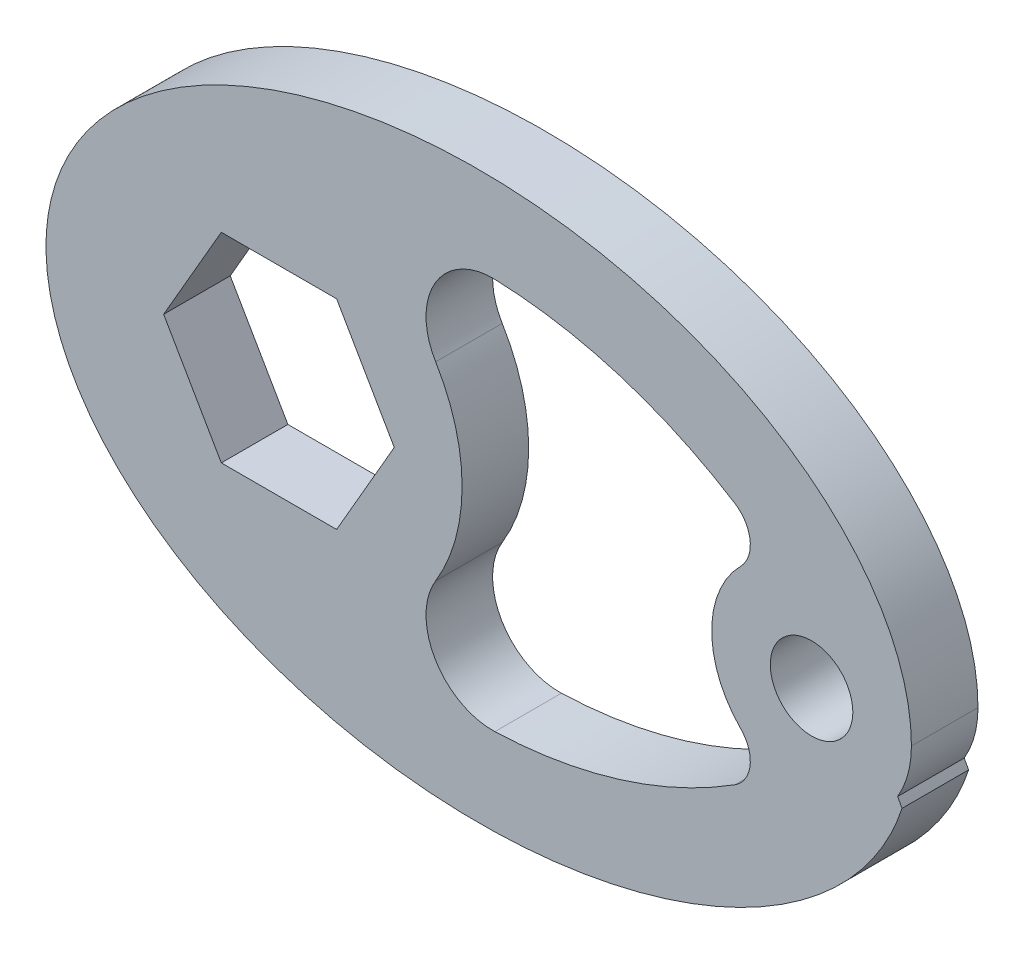
ISO-10303-21;
HEADER;
FILE_DESCRIPTION(('STEP AP214'),'2;1');
FILE_NAME('part.step','',(''),(''),'','','');
FILE_SCHEMA(('AUTOMOTIVE_DESIGN { 1 0 10303 214 1 1 1 1 }'));
ENDSEC;
DATA;
#1=APPLICATION_CONTEXT('core data for automotive mechanical design processes');
#2=APPLICATION_PROTOCOL_DEFINITION('international standard','automotive_design',2000,#1);
#3=PRODUCT_CONTEXT('',#1,'mechanical');
#4=PRODUCT('Part','Part','',(#3));
#5=PRODUCT_RELATED_PRODUCT_CATEGORY('part','',(#4));
#6=PRODUCT_DEFINITION_FORMATION('','',#4);
#7=PRODUCT_DEFINITION_CONTEXT('part definition',#1,'design');
#8=PRODUCT_DEFINITION('design','',#6,#7);
#9=PRODUCT_DEFINITION_SHAPE('','',#8);
#10=(LENGTH_UNIT() NAMED_UNIT(*) SI_UNIT(.MILLI.,.METRE.));
#11=(NAMED_UNIT(*) PLANE_ANGLE_UNIT() SI_UNIT($,.RADIAN.));
#12=(NAMED_UNIT(*) SI_UNIT($,.STERADIAN.) SOLID_ANGLE_UNIT());
#13=UNCERTAINTY_MEASURE_WITH_UNIT(LENGTH_MEASURE(1.E-05),#10,'distance_accuracy_value','');
#14=(GEOMETRIC_REPRESENTATION_CONTEXT(3) GLOBAL_UNCERTAINTY_ASSIGNED_CONTEXT((#13)) GLOBAL_UNIT_ASSIGNED_CONTEXT((#10,
#11,#12)) REPRESENTATION_CONTEXT('',''));
#15=CARTESIAN_POINT('',(0.,0.,0.));
#16=DIRECTION('',(0.,0.,1.));
#17=DIRECTION('',(1.,0.,0.));
#18=AXIS2_PLACEMENT_3D('',#15,#16,#17);
#19=CARTESIAN_POINT('',(63.5,0.,12.7));
#20=DIRECTION('',(0.,0.,-1.));
#21=DIRECTION('',(-1.,0.,0.));
#22=AXIS2_PLACEMENT_3D('',#19,#20,#21);
#23=CYLINDRICAL_SURFACE('',#22,19.05);
#24=CARTESIAN_POINT('',(63.5,0.,0.));
#25=DIRECTION('',(0.,0.,1.));
#26=DIRECTION('',(1.,0.,0.));
#27=AXIS2_PLACEMENT_3D('',#24,#25,#26);
#28=CIRCLE('',#27,19.05);
#29=CARTESIAN_POINT('',(79.9202009180648,-9.65813138295304,0.));
#30=VERTEX_POINT('',#29);
#31=CARTESIAN_POINT('',(82.55,0.,0.));
#32=VERTEX_POINT('',#31);
#33=EDGE_CURVE('E174',#30,#32,#28,.T.);
#34=ORIENTED_EDGE('',*,*,#33,.T.);
#35=DIRECTION('',(0.,0.,-1.));
#36=VECTOR('',#35,1.);
#37=CARTESIAN_POINT('',(82.55,0.,12.7));
#38=LINE('',#37,#36);
#39=CARTESIAN_POINT('',(82.55,0.,12.7));
#40=VERTEX_POINT('',#39);
#41=EDGE_CURVE('E11',#40,#32,#38,.T.);
#42=ORIENTED_EDGE('',*,*,#41,.F.);
#43=CARTESIAN_POINT('',(63.5,0.,12.7));
#44=DIRECTION('',(0.,0.,1.));
#45=DIRECTION('',(1.,0.,0.));
#46=AXIS2_PLACEMENT_3D('',#43,#44,#45);
#47=CIRCLE('',#46,19.05);
#48=CARTESIAN_POINT('',(79.9202009180648,-9.65813138295304,12.7));
#49=VERTEX_POINT('',#48);
#50=EDGE_CURVE('E166',#49,#40,#47,.T.);
#51=ORIENTED_EDGE('',*,*,#50,.F.);
#52=DIRECTION('',(0.,0.,-1.));
#53=VECTOR('',#52,1.);
#54=CARTESIAN_POINT('',(79.9202009180648,-9.65813138295304,12.7));
#55=LINE('',#54,#53);
#56=EDGE_CURVE('E175',#49,#30,#55,.T.);
#57=ORIENTED_EDGE('',*,*,#56,.T.);
#58=EDGE_LOOP('',(#34,#42,#51,#57));
#59=FACE_BOUND('',#58,.T.);
#60=ADVANCED_FACE('F35',(#59),#23,.T.);
#61=CARTESIAN_POINT('',(0.,0.,12.7));
#62=DIRECTION('',(0.,0.,1.));
#63=DIRECTION('',(1.,0.,0.));
#64=AXIS2_PLACEMENT_3D('',#61,#62,#63);
#65=ELLIPSE('',#64,82.55,53.975);
#66=DIRECTION('',(0.,0.,-1.));
#67=VECTOR('',#66,1.);
#68=SURFACE_OF_LINEAR_EXTRUSION('',#65,#67);
#69=CARTESIAN_POINT('',(0.,0.,0.));
#70=DIRECTION('',(0.,0.,1.));
#71=DIRECTION('',(1.,0.,0.));
#72=AXIS2_PLACEMENT_3D('',#69,#70,#71);
#73=ELLIPSE('',#72,82.55,53.975);
#74=CARTESIAN_POINT('',(80.7542674563198,-11.1968321290213,0.));
#75=VERTEX_POINT('',#74);
#76=EDGE_CURVE('E108',#32,#75,#73,.T.);
#77=ORIENTED_EDGE('',*,*,#76,.T.);
#78=DIRECTION('',(0.,0.,-1.));
#79=VECTOR('',#78,1.);
#80=CARTESIAN_POINT('',(80.7542674563198,-11.1968321290213,12.7));
#81=LINE('',#80,#79);
#82=CARTESIAN_POINT('',(80.7542674563198,-11.1968321290213,12.7));
#83=VERTEX_POINT('',#82);
#84=EDGE_CURVE('E45',#83,#75,#81,.T.);
#85=ORIENTED_EDGE('',*,*,#84,.F.);
#86=EDGE_CURVE('E162',#40,#83,#65,.T.);
#87=ORIENTED_EDGE('',*,*,#86,.F.);
#88=ORIENTED_EDGE('',*,*,#41,.T.);
#89=EDGE_LOOP('',(#77,#85,#87,#88));
#90=FACE_BOUND('',#89,.T.);
#91=ADVANCED_FACE('F163',(#90),#68,.F.);
#92=CARTESIAN_POINT('',(-12.0772160579065,6.97278394209356,12.7));
#93=DIRECTION('',(-0.866025403784439,0.5,0.));
#94=DIRECTION('',(-0.5,-0.866025403784439,0.));
#95=AXIS2_PLACEMENT_3D('',#92,#93,#94);
#96=PLANE('',#95);
#97=DIRECTION('',(0.5,0.866025403784439,0.));
#98=VECTOR('',#97,1.);
#99=CARTESIAN_POINT('',(-12.0772160579065,6.97278394209356,0.));
#100=LINE('',#99,#98);
#101=CARTESIAN_POINT('',(-27.1014773719376,-19.05,0.));
#102=VERTEX_POINT('',#101);
#103=CARTESIAN_POINT('',(-16.1029547438753,0.,0.));
#104=VERTEX_POINT('',#103);
#105=EDGE_CURVE('E253',#102,#104,#100,.T.);
#106=ORIENTED_EDGE('',*,*,#105,.F.);
#107=DIRECTION('',(0.,0.,-1.));
#108=VECTOR('',#107,1.);
#109=CARTESIAN_POINT('',(-27.1014773719376,-19.05,12.7));
#110=LINE('',#109,#108);
#111=CARTESIAN_POINT('',(-27.1014773719376,-19.05,12.7));
#112=VERTEX_POINT('',#111);
#113=EDGE_CURVE('E188',#112,#102,#110,.T.);
#114=ORIENTED_EDGE('',*,*,#113,.F.);
#115=DIRECTION('',(0.5,0.866025403784439,0.));
#116=VECTOR('',#115,1.);
#117=CARTESIAN_POINT('',(-12.0772160579065,6.97278394209356,12.7));
#118=LINE('',#117,#116);
#119=CARTESIAN_POINT('',(-16.1029547438753,0.,12.7));
#120=VERTEX_POINT('',#119);
#121=EDGE_CURVE('E303',#112,#120,#118,.T.);
#122=ORIENTED_EDGE('',*,*,#121,.T.);
#123=DIRECTION('',(0.,0.,-1.));
#124=VECTOR('',#123,1.);
#125=CARTESIAN_POINT('',(-16.1029547438753,0.,12.7));
#126=LINE('',#125,#124);
#127=EDGE_CURVE('E190',#120,#104,#126,.T.);
#128=ORIENTED_EDGE('',*,*,#127,.T.);
#129=EDGE_LOOP('',(#106,#114,#122,#128));
#130=FACE_BOUND('',#129,.T.);
#131=ADVANCED_FACE('F302',(#130),#96,.T.);
#132=CARTESIAN_POINT('',(0.,-19.05,12.7));
#133=DIRECTION('',(0.,1.,0.));
#134=DIRECTION('',(-1.,0.,0.));
#135=AXIS2_PLACEMENT_3D('',#132,#133,#134);
#136=PLANE('',#135);
#137=DIRECTION('',(1.,0.,0.));
#138=VECTOR('',#137,1.);
#139=CARTESIAN_POINT('',(0.,-19.05,0.));
#140=LINE('',#139,#138);
#141=CARTESIAN_POINT('',(-49.0985226280624,-19.05,0.));
#142=VERTEX_POINT('',#141);
#143=EDGE_CURVE('E256',#142,#102,#140,.T.);
#144=ORIENTED_EDGE('',*,*,#143,.F.);
#145=DIRECTION('',(0.,0.,-1.));
#146=VECTOR('',#145,1.);
#147=CARTESIAN_POINT('',(-49.0985226280624,-19.05,12.7));
#148=LINE('',#147,#146);
#149=CARTESIAN_POINT('',(-49.0985226280624,-19.05,12.7));
#150=VERTEX_POINT('',#149);
#151=EDGE_CURVE('E198',#150,#142,#148,.T.);
#152=ORIENTED_EDGE('',*,*,#151,.F.);
#153=DIRECTION('',(1.,0.,0.));
#154=VECTOR('',#153,1.);
#155=CARTESIAN_POINT('',(0.,-19.05,12.7));
#156=LINE('',#155,#154);
#157=EDGE_CURVE('E299',#150,#112,#156,.T.);
#158=ORIENTED_EDGE('',*,*,#157,.T.);
#159=ORIENTED_EDGE('',*,*,#113,.T.);
#160=EDGE_LOOP('',(#144,#152,#158,#159));
#161=FACE_BOUND('',#160,.T.);
#162=ADVANCED_FACE('F298',(#161),#136,.T.);
#163=CARTESIAN_POINT('',(-45.0727839420935,-26.0227839420936,12.7));
#164=DIRECTION('',(0.866025403784439,0.5,0.));
#165=DIRECTION('',(-0.5,0.866025403784439,0.));
#166=AXIS2_PLACEMENT_3D('',#163,#164,#165);
#167=PLANE('',#166);
#168=DIRECTION('',(0.5,-0.866025403784439,0.));
#169=VECTOR('',#168,1.);
#170=CARTESIAN_POINT('',(-45.0727839420935,-26.0227839420936,0.));
#171=LINE('',#170,#169);
#172=CARTESIAN_POINT('',(-60.0970452561248,0.,0.));
#173=VERTEX_POINT('',#172);
#174=EDGE_CURVE('E259',#173,#142,#171,.T.);
#175=ORIENTED_EDGE('',*,*,#174,.F.);
#176=DIRECTION('',(0.,0.,-1.));
#177=VECTOR('',#176,1.);
#178=CARTESIAN_POINT('',(-60.0970452561248,0.,12.7));
#179=LINE('',#178,#177);
#180=CARTESIAN_POINT('',(-60.0970452561248,0.,12.7));
#181=VERTEX_POINT('',#180);
#182=EDGE_CURVE('E196',#181,#173,#179,.T.);
#183=ORIENTED_EDGE('',*,*,#182,.F.);
#184=DIRECTION('',(0.5,-0.866025403784439,0.));
#185=VECTOR('',#184,1.);
#186=CARTESIAN_POINT('',(-45.0727839420935,-26.0227839420936,12.7));
#187=LINE('',#186,#185);
#188=EDGE_CURVE('E294',#181,#150,#187,.T.);
#189=ORIENTED_EDGE('',*,*,#188,.T.);
#190=ORIENTED_EDGE('',*,*,#151,.T.);
#191=EDGE_LOOP('',(#175,#183,#189,#190));
#192=FACE_BOUND('',#191,.T.);
#193=ADVANCED_FACE('F291',(#192),#167,.T.);
#194=CARTESIAN_POINT('',(-45.0727839420936,26.0227839420936,12.7));
#195=DIRECTION('',(0.866025403784439,-0.5,0.));
#196=DIRECTION('',(0.5,0.866025403784439,0.));
#197=AXIS2_PLACEMENT_3D('',#194,#195,#196);
#198=PLANE('',#197);
#199=DIRECTION('',(-0.5,-0.866025403784439,0.));
#200=VECTOR('',#199,1.);
#201=CARTESIAN_POINT('',(-45.0727839420936,26.0227839420936,0.));
#202=LINE('',#201,#200);
#203=CARTESIAN_POINT('',(-49.0985226280624,19.05,0.));
#204=VERTEX_POINT('',#203);
#205=EDGE_CURVE('E262',#204,#173,#202,.T.);
#206=ORIENTED_EDGE('',*,*,#205,.F.);
#207=DIRECTION('',(0.,0.,-1.));
#208=VECTOR('',#207,1.);
#209=CARTESIAN_POINT('',(-49.0985226280624,19.05,12.7));
#210=LINE('',#209,#208);
#211=CARTESIAN_POINT('',(-49.0985226280624,19.05,12.7));
#212=VERTEX_POINT('',#211);
#213=EDGE_CURVE('E194',#212,#204,#210,.T.);
#214=ORIENTED_EDGE('',*,*,#213,.F.);
#215=DIRECTION('',(-0.5,-0.866025403784439,0.));
#216=VECTOR('',#215,1.);
#217=CARTESIAN_POINT('',(-45.0727839420936,26.0227839420936,12.7));
#218=LINE('',#217,#216);
#219=EDGE_CURVE('E311',#212,#181,#218,.T.);
#220=ORIENTED_EDGE('',*,*,#219,.T.);
#221=ORIENTED_EDGE('',*,*,#182,.T.);
#222=EDGE_LOOP('',(#206,#214,#220,#221));
#223=FACE_BOUND('',#222,.T.);
#224=ADVANCED_FACE('F287',(#223),#198,.T.);
#225=CARTESIAN_POINT('',(0.,19.05,12.7));
#226=DIRECTION('',(0.,-1.,0.));
#227=DIRECTION('',(1.,0.,0.));
#228=AXIS2_PLACEMENT_3D('',#225,#226,#227);
#229=PLANE('',#228);
#230=DIRECTION('',(-1.,0.,0.));
#231=VECTOR('',#230,1.);
#232=CARTESIAN_POINT('',(0.,19.05,0.));
#233=LINE('',#232,#231);
#234=CARTESIAN_POINT('',(-27.1014773719376,19.05,0.));
#235=VERTEX_POINT('',#234);
#236=EDGE_CURVE('E265',#235,#204,#233,.T.);
#237=ORIENTED_EDGE('',*,*,#236,.F.);
#238=DIRECTION('',(0.,0.,-1.));
#239=VECTOR('',#238,1.);
#240=CARTESIAN_POINT('',(-27.1014773719376,19.05,12.7));
#241=LINE('',#240,#239);
#242=CARTESIAN_POINT('',(-27.1014773719376,19.05,12.7));
#243=VERTEX_POINT('',#242);
#244=EDGE_CURVE('E192',#243,#235,#241,.T.);
#245=ORIENTED_EDGE('',*,*,#244,.F.);
#246=DIRECTION('',(-1.,0.,0.));
#247=VECTOR('',#246,1.);
#248=CARTESIAN_POINT('',(0.,19.05,12.7));
#249=LINE('',#248,#247);
#250=EDGE_CURVE('E283',#243,#212,#249,.T.);
#251=ORIENTED_EDGE('',*,*,#250,.T.);
#252=ORIENTED_EDGE('',*,*,#213,.T.);
#253=EDGE_LOOP('',(#237,#245,#251,#252));
#254=FACE_BOUND('',#253,.T.);
#255=ADVANCED_FACE('F281',(#254),#229,.T.);
#256=CARTESIAN_POINT('',(2.65555798937363,-24.6652038216592,12.7));
#257=DIRECTION('',(0.,0.,-1.));
#258=DIRECTION('',(-1.,0.,0.));
#259=AXIS2_PLACEMENT_3D('',#256,#257,#258);
#260=CYLINDRICAL_SURFACE('',#259,12.7);
#261=CARTESIAN_POINT('',(2.65555798937363,-24.6652038216592,0.));
#262=DIRECTION('',(0.,0.,1.));
#263=DIRECTION('',(1.,0.,0.));
#264=AXIS2_PLACEMENT_3D('',#261,#262,#263);
#265=CIRCLE('',#264,12.7);
#266=CARTESIAN_POINT('',(-8.20960405503424,-18.089623714265,0.));
#267=VERTEX_POINT('',#266);
#268=CARTESIAN_POINT('',(3.08417302941597,-37.3579690502235,0.));
#269=VERTEX_POINT('',#268);
#270=EDGE_CURVE('E232',#267,#269,#265,.T.);
#271=ORIENTED_EDGE('',*,*,#270,.F.);
#272=DIRECTION('',(0.,0.,-1.));
#273=VECTOR('',#272,1.);
#274=CARTESIAN_POINT('',(-8.20960405503424,-18.089623714265,12.7));
#275=LINE('',#274,#273);
#276=CARTESIAN_POINT('',(-8.20960405503424,-18.089623714265,12.7));
#277=VERTEX_POINT('',#276);
#278=EDGE_CURVE('E39',#277,#267,#275,.T.);
#279=ORIENTED_EDGE('',*,*,#278,.F.);
#280=CARTESIAN_POINT('',(2.65555798937363,-24.6652038216592,12.7));
#281=DIRECTION('',(0.,0.,1.));
#282=DIRECTION('',(1.,0.,0.));
#283=AXIS2_PLACEMENT_3D('',#280,#281,#282);
#284=CIRCLE('',#283,12.7);
#285=CARTESIAN_POINT('',(3.08417302941597,-37.3579690502235,12.7));
#286=VERTEX_POINT('',#285);
#287=EDGE_CURVE('E186',#277,#286,#284,.T.);
#288=ORIENTED_EDGE('',*,*,#287,.T.);
#289=DIRECTION('',(0.,0.,-1.));
#290=VECTOR('',#289,1.);
#291=CARTESIAN_POINT('',(3.08417302941597,-37.3579690502235,12.7));
#292=LINE('',#291,#290);
#293=EDGE_CURVE('E201',#286,#269,#292,.T.);
#294=ORIENTED_EDGE('',*,*,#293,.T.);
#295=EDGE_LOOP('',(#271,#279,#288,#294));
#296=FACE_BOUND('',#295,.T.);
#297=ADVANCED_FACE('F37',(#296),#260,.F.);
#298=CARTESIAN_POINT('',(-38.1,0.,12.7));
#299=DIRECTION('',(0.,0.,-1.));
#300=DIRECTION('',(-1.,0.,0.));
#301=AXIS2_PLACEMENT_3D('',#298,#299,#300);
#302=CYLINDRICAL_SURFACE('',#301,34.9380917605774);
#303=CARTESIAN_POINT('',(-38.1,0.,0.));
#304=DIRECTION('',(0.,0.,1.));
#305=DIRECTION('',(1.,0.,0.));
#306=AXIS2_PLACEMENT_3D('',#303,#304,#305);
#307=CIRCLE('',#306,34.9380917605774);
#308=CARTESIAN_POINT('',(-8.20960405503424,18.089623714265,0.));
#309=VERTEX_POINT('',#308);
#310=EDGE_CURVE('E224',#267,#309,#307,.T.);
#311=ORIENTED_EDGE('',*,*,#310,.T.);
#312=DIRECTION('',(0.,0.,-1.));
#313=VECTOR('',#312,1.);
#314=CARTESIAN_POINT('',(-8.20960405503424,18.089623714265,12.7));
#315=LINE('',#314,#313);
#316=CARTESIAN_POINT('',(-8.20960405503424,18.089623714265,12.7));
#317=VERTEX_POINT('',#316);
#318=EDGE_CURVE('E214',#317,#309,#315,.T.);
#319=ORIENTED_EDGE('',*,*,#318,.F.);
#320=CARTESIAN_POINT('',(-38.1,0.,12.7));
#321=DIRECTION('',(0.,0.,1.));
#322=DIRECTION('',(1.,0.,0.));
#323=AXIS2_PLACEMENT_3D('',#320,#321,#322);
#324=CIRCLE('',#323,34.9380917605774);
#325=EDGE_CURVE('E225',#277,#317,#324,.T.);
#326=ORIENTED_EDGE('',*,*,#325,.F.);
#327=ORIENTED_EDGE('',*,*,#278,.T.);
#328=EDGE_LOOP('',(#311,#319,#326,#327));
#329=FACE_BOUND('',#328,.T.);
#330=ADVANCED_FACE('F223',(#329),#302,.T.);
#331=CARTESIAN_POINT('',(2.65555798937363,24.6652038216592,12.7));
#332=DIRECTION('',(0.,0.,-1.));
#333=DIRECTION('',(-1.,0.,0.));
#334=AXIS2_PLACEMENT_3D('',#331,#332,#333);
#335=CYLINDRICAL_SURFACE('',#334,12.7);
#336=CARTESIAN_POINT('',(2.65555798937363,24.6652038216592,0.));
#337=DIRECTION('',(0.,0.,1.));
#338=DIRECTION('',(1.,0.,0.));
#339=AXIS2_PLACEMENT_3D('',#336,#337,#338);
#340=CIRCLE('',#339,12.7);
#341=CARTESIAN_POINT('',(3.08417302941596,37.3579690502235,0.));
#342=VERTEX_POINT('',#341);
#343=EDGE_CURVE('E234',#309,#342,#340,.F.);
#344=ORIENTED_EDGE('',*,*,#343,.T.);
#345=DIRECTION('',(0.,0.,-1.));
#346=VECTOR('',#345,1.);
#347=CARTESIAN_POINT('',(3.08417302941596,37.3579690502235,12.7));
#348=LINE('',#347,#346);
#349=CARTESIAN_POINT('',(3.08417302941596,37.3579690502235,12.7));
#350=VERTEX_POINT('',#349);
#351=EDGE_CURVE('E213',#350,#342,#348,.T.);
#352=ORIENTED_EDGE('',*,*,#351,.F.);
#353=CARTESIAN_POINT('',(2.65555798937363,24.6652038216592,12.7));
#354=DIRECTION('',(0.,0.,1.));
#355=DIRECTION('',(1.,0.,0.));
#356=AXIS2_PLACEMENT_3D('',#353,#354,#355);
#357=CIRCLE('',#356,12.7);
#358=EDGE_CURVE('E490',#317,#350,#357,.F.);
#359=ORIENTED_EDGE('',*,*,#358,.F.);
#360=ORIENTED_EDGE('',*,*,#318,.T.);
#361=EDGE_LOOP('',(#344,#352,#359,#360));
#362=FACE_BOUND('',#361,.T.);
#363=ADVANCED_FACE('F358',(#362),#335,.F.);
#364=CARTESIAN_POINT('',(0.,-53.975,12.7));
#365=DIRECTION('',(0.,0.,-1.));
#366=DIRECTION('',(-1.,0.,0.));
#367=AXIS2_PLACEMENT_3D('',#364,#365,#366);
#368=CYLINDRICAL_SURFACE('',#367,91.3850280888749);
#369=CARTESIAN_POINT('',(0.,-53.975,0.));
#370=DIRECTION('',(0.,0.,1.));
#371=DIRECTION('',(1.,0.,0.));
#372=AXIS2_PLACEMENT_3D('',#369,#370,#371);
#373=CIRCLE('',#372,91.3850280888749);
#374=CARTESIAN_POINT('',(48.85977358339,23.2515879356606,0.));
#375=VERTEX_POINT('',#374);
#376=EDGE_CURVE('E242',#375,#342,#373,.T.);
#377=ORIENTED_EDGE('',*,*,#376,.F.);
#378=DIRECTION('',(0.,0.,-1.));
#379=VECTOR('',#378,1.);
#380=CARTESIAN_POINT('',(48.85977358339,23.2515879356606,12.7));
#381=LINE('',#380,#379);
#382=CARTESIAN_POINT('',(48.85977358339,23.2515879356606,12.7));
#383=VERTEX_POINT('',#382);
#384=EDGE_CURVE('E211',#383,#375,#381,.T.);
#385=ORIENTED_EDGE('',*,*,#384,.F.);
#386=CARTESIAN_POINT('',(0.,-53.975,12.7));
#387=DIRECTION('',(0.,0.,1.));
#388=DIRECTION('',(1.,0.,0.));
#389=AXIS2_PLACEMENT_3D('',#386,#387,#388);
#390=CIRCLE('',#389,91.3850280888749);
#391=EDGE_CURVE('E494',#383,#350,#390,.T.);
#392=ORIENTED_EDGE('',*,*,#391,.T.);
#393=ORIENTED_EDGE('',*,*,#351,.T.);
#394=EDGE_LOOP('',(#377,#385,#392,#393));
#395=FACE_BOUND('',#394,.T.);
#396=ADVANCED_FACE('F354',(#395),#368,.F.);
#397=CARTESIAN_POINT('',(45.4646926960395,17.8854043972092,12.7));
#398=DIRECTION('',(0.,0.,-1.));
#399=DIRECTION('',(-1.,0.,0.));
#400=AXIS2_PLACEMENT_3D('',#397,#398,#399);
#401=CYLINDRICAL_SURFACE('',#400,6.34999999999999);
#402=CARTESIAN_POINT('',(45.4646926960395,17.8854043972092,0.));
#403=DIRECTION('',(0.,0.,1.));
#404=DIRECTION('',(1.,0.,0.));
#405=AXIS2_PLACEMENT_3D('',#402,#403,#404);
#406=CIRCLE('',#405,6.34999999999999);
#407=CARTESIAN_POINT('',(49.9735195220296,13.4140532979069,0.));
#408=VERTEX_POINT('',#407);
#409=EDGE_CURVE('E244',#408,#375,#406,.T.);
#410=ORIENTED_EDGE('',*,*,#409,.F.);
#411=DIRECTION('',(0.,0.,-1.));
#412=VECTOR('',#411,1.);
#413=CARTESIAN_POINT('',(49.9735195220296,13.4140532979069,12.7));
#414=LINE('',#413,#412);
#415=CARTESIAN_POINT('',(49.9735195220296,13.4140532979069,12.7));
#416=VERTEX_POINT('',#415);
#417=EDGE_CURVE('E209',#416,#408,#414,.T.);
#418=ORIENTED_EDGE('',*,*,#417,.F.);
#419=CARTESIAN_POINT('',(45.4646926960395,17.8854043972092,12.7));
#420=DIRECTION('',(0.,0.,1.));
#421=DIRECTION('',(1.,0.,0.));
#422=AXIS2_PLACEMENT_3D('',#419,#420,#421);
#423=CIRCLE('',#422,6.34999999999999);
#424=EDGE_CURVE('E497',#416,#383,#423,.T.);
#425=ORIENTED_EDGE('',*,*,#424,.T.);
#426=ORIENTED_EDGE('',*,*,#384,.T.);
#427=EDGE_LOOP('',(#410,#418,#425,#426));
#428=FACE_BOUND('',#427,.T.);
#429=ADVANCED_FACE('F350',(#428),#401,.F.);
#430=CARTESIAN_POINT('',(63.5,0.,12.7));
#431=DIRECTION('',(0.,0.,-1.));
#432=DIRECTION('',(-1.,0.,0.));
#433=AXIS2_PLACEMENT_3D('',#430,#431,#432);
#434=CYLINDRICAL_SURFACE('',#433,19.05);
#435=CARTESIAN_POINT('',(63.5,0.,0.));
#436=DIRECTION('',(0.,0.,1.));
#437=DIRECTION('',(1.,0.,0.));
#438=AXIS2_PLACEMENT_3D('',#435,#436,#437);
#439=CIRCLE('',#438,19.05);
#440=CARTESIAN_POINT('',(49.9735195220296,-13.4140532979069,0.));
#441=VERTEX_POINT('',#440);
#442=EDGE_CURVE('E247',#408,#441,#439,.T.);
#443=ORIENTED_EDGE('',*,*,#442,.T.);
#444=DIRECTION('',(0.,0.,-1.));
#445=VECTOR('',#444,1.);
#446=CARTESIAN_POINT('',(49.9735195220296,-13.4140532979069,12.7));
#447=LINE('',#446,#445);
#448=CARTESIAN_POINT('',(49.9735195220296,-13.4140532979069,12.7));
#449=VERTEX_POINT('',#448);
#450=EDGE_CURVE('E206',#449,#441,#447,.T.);
#451=ORIENTED_EDGE('',*,*,#450,.F.);
#452=CARTESIAN_POINT('',(63.5,0.,12.7));
#453=DIRECTION('',(0.,0.,1.));
#454=DIRECTION('',(1.,0.,0.));
#455=AXIS2_PLACEMENT_3D('',#452,#453,#454);
#456=CIRCLE('',#455,19.05);
#457=EDGE_CURVE('E500',#416,#449,#456,.T.);
#458=ORIENTED_EDGE('',*,*,#457,.F.);
#459=ORIENTED_EDGE('',*,*,#417,.T.);
#460=EDGE_LOOP('',(#443,#451,#458,#459));
#461=FACE_BOUND('',#460,.T.);
#462=ADVANCED_FACE('F346',(#461),#434,.T.);
#463=CARTESIAN_POINT('',(45.4646926960395,-17.8854043972092,12.7));
#464=DIRECTION('',(0.,0.,-1.));
#465=DIRECTION('',(-1.,0.,0.));
#466=AXIS2_PLACEMENT_3D('',#463,#464,#465);
#467=CYLINDRICAL_SURFACE('',#466,6.34999999999999);
#468=CARTESIAN_POINT('',(45.4646926960395,-17.8854043972092,0.));
#469=DIRECTION('',(0.,0.,1.));
#470=DIRECTION('',(1.,0.,0.));
#471=AXIS2_PLACEMENT_3D('',#468,#469,#470);
#472=CIRCLE('',#471,6.34999999999999);
#473=CARTESIAN_POINT('',(48.85977358339,-23.2515879356606,0.));
#474=VERTEX_POINT('',#473);
#475=EDGE_CURVE('E249',#441,#474,#472,.F.);
#476=ORIENTED_EDGE('',*,*,#475,.T.);
#477=DIRECTION('',(0.,0.,-1.));
#478=VECTOR('',#477,1.);
#479=CARTESIAN_POINT('',(48.85977358339,-23.2515879356606,12.7));
#480=LINE('',#479,#478);
#481=CARTESIAN_POINT('',(48.85977358339,-23.2515879356606,12.7));
#482=VERTEX_POINT('',#481);
#483=EDGE_CURVE('E203',#482,#474,#480,.T.);
#484=ORIENTED_EDGE('',*,*,#483,.F.);
#485=CARTESIAN_POINT('',(45.4646926960395,-17.8854043972092,12.7));
#486=DIRECTION('',(0.,0.,1.));
#487=DIRECTION('',(1.,0.,0.));
#488=AXIS2_PLACEMENT_3D('',#485,#486,#487);
#489=CIRCLE('',#488,6.34999999999999);
#490=EDGE_CURVE('E502',#449,#482,#489,.F.);
#491=ORIENTED_EDGE('',*,*,#490,.F.);
#492=ORIENTED_EDGE('',*,*,#450,.T.);
#493=EDGE_LOOP('',(#476,#484,#491,#492));
#494=FACE_BOUND('',#493,.T.);
#495=ADVANCED_FACE('F326',(#494),#467,.F.);
#496=CARTESIAN_POINT('',(63.5,0.,12.7));
#497=DIRECTION('',(0.,0.,-1.));
#498=DIRECTION('',(-1.,0.,0.));
#499=AXIS2_PLACEMENT_3D('',#496,#497,#498);
#500=CYLINDRICAL_SURFACE('',#499,7.874);
#501=CARTESIAN_POINT('',(63.5,0.,12.7));
#502=DIRECTION('',(0.,0.,1.));
#503=DIRECTION('',(1.,0.,0.));
#504=AXIS2_PLACEMENT_3D('',#501,#502,#503);
#505=CIRCLE('',#504,7.874);
#506=CARTESIAN_POINT('',(71.374,0.,12.7));
#507=VERTEX_POINT('',#506);
#508=EDGE_CURVE('E171',#507,#507,#505,.T.);
#509=ORIENTED_EDGE('',*,*,#508,.T.);
#510=EDGE_LOOP('',(#509));
#511=FACE_BOUND('',#510,.T.);
#512=CARTESIAN_POINT('',(63.5,0.,0.));
#513=DIRECTION('',(0.,0.,1.));
#514=DIRECTION('',(1.,0.,0.));
#515=AXIS2_PLACEMENT_3D('',#512,#513,#514);
#516=CIRCLE('',#515,7.874);
#517=CARTESIAN_POINT('',(71.374,0.,0.));
#518=VERTEX_POINT('',#517);
#519=EDGE_CURVE('E177',#518,#518,#516,.T.);
#520=ORIENTED_EDGE('',*,*,#519,.F.);
#521=EDGE_LOOP('',(#520));
#522=FACE_BOUND('',#521,.T.);
#523=ADVANCED_FACE('F323',(#511,#522),#500,.F.);
#524=CARTESIAN_POINT('',(-12.0772160579064,-6.97278394209356,12.7));
#525=DIRECTION('',(-0.866025403784439,-0.5,0.));
#526=DIRECTION('',(0.5,-0.866025403784439,0.));
#527=AXIS2_PLACEMENT_3D('',#524,#525,#526);
#528=PLANE('',#527);
#529=DIRECTION('',(-0.5,0.866025403784439,0.));
#530=VECTOR('',#529,1.);
#531=CARTESIAN_POINT('',(-12.0772160579064,-6.97278394209356,0.));
#532=LINE('',#531,#530);
#533=EDGE_CURVE('E181',#104,#235,#532,.T.);
#534=ORIENTED_EDGE('',*,*,#533,.F.);
#535=ORIENTED_EDGE('',*,*,#127,.F.);
#536=DIRECTION('',(-0.5,0.866025403784439,0.));
#537=VECTOR('',#536,1.);
#538=CARTESIAN_POINT('',(-12.0772160579064,-6.97278394209356,12.7));
#539=LINE('',#538,#537);
#540=EDGE_CURVE('E277',#120,#243,#539,.T.);
#541=ORIENTED_EDGE('',*,*,#540,.T.);
#542=ORIENTED_EDGE('',*,*,#244,.T.);
#543=EDGE_LOOP('',(#534,#535,#541,#542));
#544=FACE_BOUND('',#543,.T.);
#545=ADVANCED_FACE('F273',(#544),#528,.T.);
#546=CARTESIAN_POINT('',(0.,53.975,12.7));
#547=DIRECTION('',(0.,0.,-1.));
#548=DIRECTION('',(-1.,0.,0.));
#549=AXIS2_PLACEMENT_3D('',#546,#547,#548);
#550=CYLINDRICAL_SURFACE('',#549,91.3850280888749);
#551=CARTESIAN_POINT('',(0.,53.975,0.));
#552=DIRECTION('',(0.,0.,1.));
#553=DIRECTION('',(1.,0.,0.));
#554=AXIS2_PLACEMENT_3D('',#551,#552,#553);
#555=CIRCLE('',#554,91.3850280888749);
#556=EDGE_CURVE('E251',#474,#269,#555,.F.);
#557=ORIENTED_EDGE('',*,*,#556,.T.);
#558=ORIENTED_EDGE('',*,*,#293,.F.);
#559=CARTESIAN_POINT('',(0.,53.975,12.7));
#560=DIRECTION('',(0.,0.,1.));
#561=DIRECTION('',(1.,0.,0.));
#562=AXIS2_PLACEMENT_3D('',#559,#560,#561);
#563=CIRCLE('',#562,91.3850280888749);
#564=EDGE_CURVE('E305',#482,#286,#563,.F.);
#565=ORIENTED_EDGE('',*,*,#564,.F.);
#566=ORIENTED_EDGE('',*,*,#483,.T.);
#567=EDGE_LOOP('',(#557,#558,#565,#566));
#568=FACE_BOUND('',#567,.T.);
#569=ADVANCED_FACE('F330',(#568),#550,.F.);
#570=CARTESIAN_POINT('',(0.,-53.975,12.7));
#571=DIRECTION('',(0.,0.,-1.));
#572=DIRECTION('',(-1.,0.,0.));
#573=AXIS2_PLACEMENT_3D('',#570,#571,#572);
#574=CYLINDRICAL_SURFACE('',#573,91.3850280888749);
#575=CARTESIAN_POINT('',(0.,-53.975,0.));
#576=DIRECTION('',(0.,0.,1.));
#577=DIRECTION('',(1.,0.,0.));
#578=AXIS2_PLACEMENT_3D('',#575,#576,#577);
#579=CIRCLE('',#578,91.3850280888749);
#580=EDGE_CURVE('E114',#75,#30,#579,.T.);
#581=ORIENTED_EDGE('',*,*,#580,.T.);
#582=ORIENTED_EDGE('',*,*,#56,.F.);
#583=CARTESIAN_POINT('',(0.,-53.975,12.7));
#584=DIRECTION('',(0.,0.,1.));
#585=DIRECTION('',(1.,0.,0.));
#586=AXIS2_PLACEMENT_3D('',#583,#584,#585);
#587=CIRCLE('',#586,91.3850280888749);
#588=EDGE_CURVE('E54',#83,#49,#587,.T.);
#589=ORIENTED_EDGE('',*,*,#588,.F.);
#590=ORIENTED_EDGE('',*,*,#84,.T.);
#591=EDGE_LOOP('',(#581,#582,#589,#590));
#592=FACE_BOUND('',#591,.T.);
#593=ADVANCED_FACE('F319',(#592),#574,.T.);
#594=CARTESIAN_POINT('',(0.,0.,12.7));
#595=DIRECTION('',(0.,0.,1.));
#596=DIRECTION('',(1.,0.,0.));
#597=AXIS2_PLACEMENT_3D('',#594,#595,#596);
#598=PLANE('',#597);
#599=ORIENTED_EDGE('',*,*,#287,.F.);
#600=ORIENTED_EDGE('',*,*,#325,.T.);
#601=ORIENTED_EDGE('',*,*,#358,.T.);
#602=ORIENTED_EDGE('',*,*,#391,.F.);
#603=ORIENTED_EDGE('',*,*,#424,.F.);
#604=ORIENTED_EDGE('',*,*,#457,.T.);
#605=ORIENTED_EDGE('',*,*,#490,.T.);
#606=ORIENTED_EDGE('',*,*,#564,.T.);
#607=EDGE_LOOP('',(#599,#600,#601,#602,#603,#604,#605,#606));
#608=FACE_BOUND('',#607,.T.);
#609=ORIENTED_EDGE('',*,*,#121,.F.);
#610=ORIENTED_EDGE('',*,*,#157,.F.);
#611=ORIENTED_EDGE('',*,*,#188,.F.);
#612=ORIENTED_EDGE('',*,*,#219,.F.);
#613=ORIENTED_EDGE('',*,*,#250,.F.);
#614=ORIENTED_EDGE('',*,*,#540,.F.);
#615=EDGE_LOOP('',(#609,#610,#611,#612,#613,#614));
#616=FACE_BOUND('',#615,.T.);
#617=ORIENTED_EDGE('',*,*,#508,.F.);
#618=EDGE_LOOP('',(#617));
#619=FACE_BOUND('',#618,.T.);
#620=ORIENTED_EDGE('',*,*,#50,.T.);
#621=ORIENTED_EDGE('',*,*,#86,.T.);
#622=ORIENTED_EDGE('',*,*,#588,.T.);
#623=EDGE_LOOP('',(#620,#621,#622));
#624=FACE_BOUND('',#623,.T.);
#625=ADVANCED_FACE('F169',(#608,#616,#619,#624),#598,.T.);
#626=CARTESIAN_POINT('',(0.,0.,0.));
#627=DIRECTION('',(0.,0.,1.));
#628=DIRECTION('',(1.,0.,0.));
#629=AXIS2_PLACEMENT_3D('',#626,#627,#628);
#630=PLANE('',#629);
#631=ORIENTED_EDGE('',*,*,#270,.T.);
#632=ORIENTED_EDGE('',*,*,#556,.F.);
#633=ORIENTED_EDGE('',*,*,#475,.F.);
#634=ORIENTED_EDGE('',*,*,#442,.F.);
#635=ORIENTED_EDGE('',*,*,#409,.T.);
#636=ORIENTED_EDGE('',*,*,#376,.T.);
#637=ORIENTED_EDGE('',*,*,#343,.F.);
#638=ORIENTED_EDGE('',*,*,#310,.F.);
#639=EDGE_LOOP('',(#631,#632,#633,#634,#635,#636,#637,#638));
#640=FACE_BOUND('',#639,.T.);
#641=ORIENTED_EDGE('',*,*,#105,.T.);
#642=ORIENTED_EDGE('',*,*,#533,.T.);
#643=ORIENTED_EDGE('',*,*,#236,.T.);
#644=ORIENTED_EDGE('',*,*,#205,.T.);
#645=ORIENTED_EDGE('',*,*,#174,.T.);
#646=ORIENTED_EDGE('',*,*,#143,.T.);
#647=EDGE_LOOP('',(#641,#642,#643,#644,#645,#646));
#648=FACE_BOUND('',#647,.T.);
#649=ORIENTED_EDGE('',*,*,#519,.T.);
#650=EDGE_LOOP('',(#649));
#651=FACE_BOUND('',#650,.T.);
#652=ORIENTED_EDGE('',*,*,#33,.F.);
#653=ORIENTED_EDGE('',*,*,#580,.F.);
#654=ORIENTED_EDGE('',*,*,#76,.F.);
#655=EDGE_LOOP('',(#652,#653,#654));
#656=FACE_BOUND('',#655,.T.);
#657=ADVANCED_FACE('F229',(#640,#648,#651,#656),#630,.F.);
#658=CLOSED_SHELL('',(#60,#91,#131,#162,#193,#224,#255,#297,#330,#363,#396,#429,#462,#495,#523,
#545,#569,#593,#625,#657));
#659=MANIFOLD_SOLID_BREP('B2',#658);
#660=ADVANCED_BREP_SHAPE_REPRESENTATION('',(#18,#659),#14);
#661=SHAPE_DEFINITION_REPRESENTATION(#9,#660);
ENDSEC;
END-ISO-10303-21;
